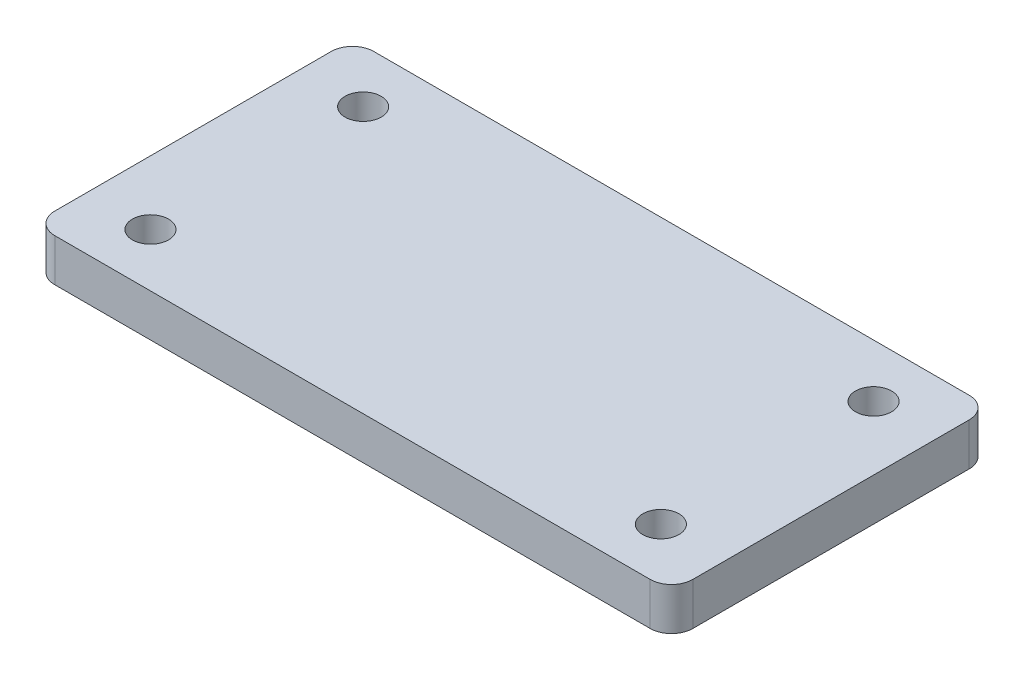
ISO-10303-21;
HEADER;
FILE_DESCRIPTION(('STEP AP214'),'2;1');
FILE_NAME('part.step','',(''),(''),'','','');
FILE_SCHEMA(('AUTOMOTIVE_DESIGN { 1 0 10303 214 1 1 1 1 }'));
ENDSEC;
DATA;
#1=APPLICATION_CONTEXT('core data for automotive mechanical design processes');
#2=APPLICATION_PROTOCOL_DEFINITION('international standard','automotive_design',2000,#1);
#3=PRODUCT_CONTEXT('',#1,'mechanical');
#4=PRODUCT('Part','Part','',(#3));
#5=PRODUCT_RELATED_PRODUCT_CATEGORY('part','',(#4));
#6=PRODUCT_DEFINITION_FORMATION('','',#4);
#7=PRODUCT_DEFINITION_CONTEXT('part definition',#1,'design');
#8=PRODUCT_DEFINITION('design','',#6,#7);
#9=PRODUCT_DEFINITION_SHAPE('','',#8);
#10=(LENGTH_UNIT() NAMED_UNIT(*) SI_UNIT(.MILLI.,.METRE.));
#11=(NAMED_UNIT(*) PLANE_ANGLE_UNIT() SI_UNIT($,.RADIAN.));
#12=(NAMED_UNIT(*) SI_UNIT($,.STERADIAN.) SOLID_ANGLE_UNIT());
#13=UNCERTAINTY_MEASURE_WITH_UNIT(LENGTH_MEASURE(1.E-05),#10,'distance_accuracy_value','');
#14=(GEOMETRIC_REPRESENTATION_CONTEXT(3) GLOBAL_UNCERTAINTY_ASSIGNED_CONTEXT((#13)) GLOBAL_UNIT_ASSIGNED_CONTEXT((#10,
#11,#12)) REPRESENTATION_CONTEXT('',''));
#15=CARTESIAN_POINT('',(0.,0.,0.));
#16=DIRECTION('',(0.,0.,1.));
#17=DIRECTION('',(1.,0.,0.));
#18=AXIS2_PLACEMENT_3D('',#15,#16,#17);
#19=CARTESIAN_POINT('',(-140.,20.,65.));
#20=DIRECTION('',(0.,-1.,0.));
#21=DIRECTION('',(0.,0.,-1.));
#22=AXIS2_PLACEMENT_3D('',#19,#20,#21);
#23=PLANE('',#22);
#24=CARTESIAN_POINT('',(-120.,20.,-50.));
#25=DIRECTION('',(0.,1.,0.));
#26=DIRECTION('',(0.,0.,1.));
#27=AXIS2_PLACEMENT_3D('',#24,#25,#26);
#28=CIRCLE('',#27,8.49999999999999);
#29=CARTESIAN_POINT('',(-120.,20.,-41.5));
#30=VERTEX_POINT('',#29);
#31=EDGE_CURVE('E198',#30,#30,#28,.T.);
#32=ORIENTED_EDGE('',*,*,#31,.F.);
#33=EDGE_LOOP('',(#32));
#34=FACE_BOUND('',#33,.T.);
#35=CARTESIAN_POINT('',(-120.,20.,50.));
#36=DIRECTION('',(0.,1.,0.));
#37=DIRECTION('',(0.,0.,1.));
#38=AXIS2_PLACEMENT_3D('',#35,#36,#37);
#39=CIRCLE('',#38,8.49999999999999);
#40=CARTESIAN_POINT('',(-120.,20.,58.5));
#41=VERTEX_POINT('',#40);
#42=EDGE_CURVE('E192',#41,#41,#39,.T.);
#43=ORIENTED_EDGE('',*,*,#42,.F.);
#44=EDGE_LOOP('',(#43));
#45=FACE_BOUND('',#44,.T.);
#46=CARTESIAN_POINT('',(120.,20.,50.));
#47=DIRECTION('',(0.,1.,0.));
#48=DIRECTION('',(0.,0.,1.));
#49=AXIS2_PLACEMENT_3D('',#46,#47,#48);
#50=CIRCLE('',#49,8.49999999999999);
#51=CARTESIAN_POINT('',(120.,20.,58.5));
#52=VERTEX_POINT('',#51);
#53=EDGE_CURVE('E186',#52,#52,#50,.T.);
#54=ORIENTED_EDGE('',*,*,#53,.F.);
#55=EDGE_LOOP('',(#54));
#56=FACE_BOUND('',#55,.T.);
#57=CARTESIAN_POINT('',(-140.,20.,65.));
#58=DIRECTION('',(0.,1.,0.));
#59=DIRECTION('',(0.,0.,-1.));
#60=AXIS2_PLACEMENT_3D('',#57,#58,#59);
#61=CIRCLE('',#60,10.);
#62=CARTESIAN_POINT('',(-150.,20.,64.9999999999999));
#63=VERTEX_POINT('',#62);
#64=CARTESIAN_POINT('',(-140.,20.,75.));
#65=VERTEX_POINT('',#64);
#66=EDGE_CURVE('E145',#63,#65,#61,.T.);
#67=ORIENTED_EDGE('',*,*,#66,.T.);
#68=DIRECTION('',(1.,0.,0.));
#69=VECTOR('',#68,1.);
#70=CARTESIAN_POINT('',(140.,20.,75.));
#71=LINE('',#70,#69);
#72=CARTESIAN_POINT('',(140.,20.,75.));
#73=VERTEX_POINT('',#72);
#74=EDGE_CURVE('E93',#65,#73,#71,.T.);
#75=ORIENTED_EDGE('',*,*,#74,.T.);
#76=CARTESIAN_POINT('',(140.,20.,65.));
#77=DIRECTION('',(0.,1.,0.));
#78=DIRECTION('',(0.,0.,-1.));
#79=AXIS2_PLACEMENT_3D('',#76,#77,#78);
#80=CIRCLE('',#79,10.);
#81=CARTESIAN_POINT('',(150.,20.,64.9999999999999));
#82=VERTEX_POINT('',#81);
#83=EDGE_CURVE('E160',#73,#82,#80,.T.);
#84=ORIENTED_EDGE('',*,*,#83,.T.);
#85=DIRECTION('',(0.,0.,-1.));
#86=VECTOR('',#85,1.);
#87=CARTESIAN_POINT('',(150.,20.,-64.9999999999999));
#88=LINE('',#87,#86);
#89=CARTESIAN_POINT('',(150.,20.,-64.9999999999999));
#90=VERTEX_POINT('',#89);
#91=EDGE_CURVE('E172',#82,#90,#88,.T.);
#92=ORIENTED_EDGE('',*,*,#91,.T.);
#93=CARTESIAN_POINT('',(140.,20.,-65.));
#94=DIRECTION('',(0.,1.,0.));
#95=DIRECTION('',(0.,0.,-1.));
#96=AXIS2_PLACEMENT_3D('',#93,#94,#95);
#97=CIRCLE('',#96,10.);
#98=CARTESIAN_POINT('',(140.,20.,-75.));
#99=VERTEX_POINT('',#98);
#100=EDGE_CURVE('E112',#90,#99,#97,.T.);
#101=ORIENTED_EDGE('',*,*,#100,.T.);
#102=DIRECTION('',(-1.,0.,0.));
#103=VECTOR('',#102,1.);
#104=CARTESIAN_POINT('',(140.,20.,-75.));
#105=LINE('',#104,#103);
#106=CARTESIAN_POINT('',(-140.,20.,-75.));
#107=VERTEX_POINT('',#106);
#108=EDGE_CURVE('E106',#99,#107,#105,.T.);
#109=ORIENTED_EDGE('',*,*,#108,.T.);
#110=CARTESIAN_POINT('',(-140.,20.,-65.));
#111=DIRECTION('',(0.,1.,0.));
#112=DIRECTION('',(0.,0.,1.));
#113=AXIS2_PLACEMENT_3D('',#110,#111,#112);
#114=CIRCLE('',#113,10.);
#115=CARTESIAN_POINT('',(-150.,20.,-64.9999999999999));
#116=VERTEX_POINT('',#115);
#117=EDGE_CURVE('E110',#107,#116,#114,.T.);
#118=ORIENTED_EDGE('',*,*,#117,.T.);
#119=DIRECTION('',(0.,0.,1.));
#120=VECTOR('',#119,1.);
#121=CARTESIAN_POINT('',(-150.,20.,-64.9999999999999));
#122=LINE('',#121,#120);
#123=EDGE_CURVE('E50',#116,#63,#122,.T.);
#124=ORIENTED_EDGE('',*,*,#123,.T.);
#125=EDGE_LOOP('',(#67,#75,#84,#92,#101,#109,#118,#124));
#126=FACE_BOUND('',#125,.T.);
#127=CARTESIAN_POINT('',(120.,20.,-50.));
#128=DIRECTION('',(0.,1.,0.));
#129=DIRECTION('',(0.,0.,1.));
#130=AXIS2_PLACEMENT_3D('',#127,#128,#129);
#131=CIRCLE('',#130,8.49999999999998);
#132=CARTESIAN_POINT('',(120.,20.,-41.5));
#133=VERTEX_POINT('',#132);
#134=EDGE_CURVE('E180',#133,#133,#131,.T.);
#135=ORIENTED_EDGE('',*,*,#134,.F.);
#136=EDGE_LOOP('',(#135));
#137=FACE_BOUND('',#136,.T.);
#138=ADVANCED_FACE('F33',(#34,#45,#56,#126,#137),#23,.F.);
#139=CARTESIAN_POINT('',(-140.,20.,65.));
#140=DIRECTION('',(0.,-1.,0.));
#141=DIRECTION('',(0.,0.,-1.));
#142=AXIS2_PLACEMENT_3D('',#139,#140,#141);
#143=CYLINDRICAL_SURFACE('',#142,10.);
#144=CARTESIAN_POINT('',(-140.,0.,65.));
#145=DIRECTION('',(0.,1.,0.));
#146=DIRECTION('',(0.,0.,-1.));
#147=AXIS2_PLACEMENT_3D('',#144,#145,#146);
#148=CIRCLE('',#147,10.);
#149=CARTESIAN_POINT('',(-150.,0.,64.9999999999999));
#150=VERTEX_POINT('',#149);
#151=CARTESIAN_POINT('',(-140.,0.,75.));
#152=VERTEX_POINT('',#151);
#153=EDGE_CURVE('E130',#150,#152,#148,.T.);
#154=ORIENTED_EDGE('',*,*,#153,.T.);
#155=DIRECTION('',(0.,-1.,0.));
#156=VECTOR('',#155,1.);
#157=CARTESIAN_POINT('',(-140.,20.,75.));
#158=LINE('',#157,#156);
#159=EDGE_CURVE('E11',#65,#152,#158,.T.);
#160=ORIENTED_EDGE('',*,*,#159,.F.);
#161=ORIENTED_EDGE('',*,*,#66,.F.);
#162=DIRECTION('',(0.,-1.,0.));
#163=VECTOR('',#162,1.);
#164=CARTESIAN_POINT('',(-150.,20.,64.9999999999999));
#165=LINE('',#164,#163);
#166=EDGE_CURVE('E126',#63,#150,#165,.T.);
#167=ORIENTED_EDGE('',*,*,#166,.T.);
#168=EDGE_LOOP('',(#154,#160,#161,#167));
#169=FACE_BOUND('',#168,.T.);
#170=ADVANCED_FACE('F35',(#169),#143,.T.);
#171=CARTESIAN_POINT('',(140.,20.,75.));
#172=DIRECTION('',(0.,0.,-1.));
#173=DIRECTION('',(-1.,0.,0.));
#174=AXIS2_PLACEMENT_3D('',#171,#172,#173);
#175=PLANE('',#174);
#176=DIRECTION('',(1.,0.,0.));
#177=VECTOR('',#176,1.);
#178=CARTESIAN_POINT('',(140.,0.,75.));
#179=LINE('',#178,#177);
#180=CARTESIAN_POINT('',(140.,0.,75.));
#181=VERTEX_POINT('',#180);
#182=EDGE_CURVE('E133',#152,#181,#179,.T.);
#183=ORIENTED_EDGE('',*,*,#182,.T.);
#184=DIRECTION('',(0.,-1.,0.));
#185=VECTOR('',#184,1.);
#186=CARTESIAN_POINT('',(140.,20.,75.));
#187=LINE('',#186,#185);
#188=EDGE_CURVE('E42',#73,#181,#187,.T.);
#189=ORIENTED_EDGE('',*,*,#188,.F.);
#190=ORIENTED_EDGE('',*,*,#74,.F.);
#191=ORIENTED_EDGE('',*,*,#159,.T.);
#192=EDGE_LOOP('',(#183,#189,#190,#191));
#193=FACE_BOUND('',#192,.T.);
#194=ADVANCED_FACE('F245',(#193),#175,.F.);
#195=CARTESIAN_POINT('',(140.,20.,65.));
#196=DIRECTION('',(0.,-1.,0.));
#197=DIRECTION('',(0.,0.,-1.));
#198=AXIS2_PLACEMENT_3D('',#195,#196,#197);
#199=CYLINDRICAL_SURFACE('',#198,10.);
#200=CARTESIAN_POINT('',(140.,0.,65.));
#201=DIRECTION('',(0.,1.,0.));
#202=DIRECTION('',(0.,0.,-1.));
#203=AXIS2_PLACEMENT_3D('',#200,#201,#202);
#204=CIRCLE('',#203,10.);
#205=CARTESIAN_POINT('',(150.,0.,64.9999999999999));
#206=VERTEX_POINT('',#205);
#207=EDGE_CURVE('E136',#181,#206,#204,.T.);
#208=ORIENTED_EDGE('',*,*,#207,.T.);
#209=DIRECTION('',(0.,-1.,0.));
#210=VECTOR('',#209,1.);
#211=CARTESIAN_POINT('',(150.,20.,64.9999999999999));
#212=LINE('',#211,#210);
#213=EDGE_CURVE('E152',#82,#206,#212,.T.);
#214=ORIENTED_EDGE('',*,*,#213,.F.);
#215=ORIENTED_EDGE('',*,*,#83,.F.);
#216=ORIENTED_EDGE('',*,*,#188,.T.);
#217=EDGE_LOOP('',(#208,#214,#215,#216));
#218=FACE_BOUND('',#217,.T.);
#219=ADVANCED_FACE('F158',(#218),#199,.T.);
#220=CARTESIAN_POINT('',(150.,20.,-64.9999999999999));
#221=DIRECTION('',(-1.,0.,0.));
#222=DIRECTION('',(0.,0.,1.));
#223=AXIS2_PLACEMENT_3D('',#220,#221,#222);
#224=PLANE('',#223);
#225=DIRECTION('',(0.,0.,-1.));
#226=VECTOR('',#225,1.);
#227=CARTESIAN_POINT('',(150.,0.,-64.9999999999999));
#228=LINE('',#227,#226);
#229=CARTESIAN_POINT('',(150.,0.,-64.9999999999999));
#230=VERTEX_POINT('',#229);
#231=EDGE_CURVE('E138',#206,#230,#228,.T.);
#232=ORIENTED_EDGE('',*,*,#231,.T.);
#233=DIRECTION('',(0.,-1.,0.));
#234=VECTOR('',#233,1.);
#235=CARTESIAN_POINT('',(150.,20.,-64.9999999999999));
#236=LINE('',#235,#234);
#237=EDGE_CURVE('E149',#90,#230,#236,.T.);
#238=ORIENTED_EDGE('',*,*,#237,.F.);
#239=ORIENTED_EDGE('',*,*,#91,.F.);
#240=ORIENTED_EDGE('',*,*,#213,.T.);
#241=EDGE_LOOP('',(#232,#238,#239,#240));
#242=FACE_BOUND('',#241,.T.);
#243=ADVANCED_FACE('F168',(#242),#224,.F.);
#244=CARTESIAN_POINT('',(140.,20.,-65.));
#245=DIRECTION('',(0.,-1.,0.));
#246=DIRECTION('',(0.,0.,-1.));
#247=AXIS2_PLACEMENT_3D('',#244,#245,#246);
#248=CYLINDRICAL_SURFACE('',#247,10.);
#249=CARTESIAN_POINT('',(140.,0.,-65.));
#250=DIRECTION('',(0.,1.,0.));
#251=DIRECTION('',(0.,0.,-1.));
#252=AXIS2_PLACEMENT_3D('',#249,#250,#251);
#253=CIRCLE('',#252,10.);
#254=CARTESIAN_POINT('',(140.,0.,-75.));
#255=VERTEX_POINT('',#254);
#256=EDGE_CURVE('E140',#230,#255,#253,.T.);
#257=ORIENTED_EDGE('',*,*,#256,.T.);
#258=DIRECTION('',(0.,-1.,0.));
#259=VECTOR('',#258,1.);
#260=CARTESIAN_POINT('',(140.,20.,-75.));
#261=LINE('',#260,#259);
#262=EDGE_CURVE('E121',#99,#255,#261,.T.);
#263=ORIENTED_EDGE('',*,*,#262,.F.);
#264=ORIENTED_EDGE('',*,*,#100,.F.);
#265=ORIENTED_EDGE('',*,*,#237,.T.);
#266=EDGE_LOOP('',(#257,#263,#264,#265));
#267=FACE_BOUND('',#266,.T.);
#268=ADVANCED_FACE('F171',(#267),#248,.T.);
#269=CARTESIAN_POINT('',(140.,20.,-75.));
#270=DIRECTION('',(0.,0.,1.));
#271=DIRECTION('',(1.,0.,0.));
#272=AXIS2_PLACEMENT_3D('',#269,#270,#271);
#273=PLANE('',#272);
#274=DIRECTION('',(-1.,0.,0.));
#275=VECTOR('',#274,1.);
#276=CARTESIAN_POINT('',(140.,0.,-75.));
#277=LINE('',#276,#275);
#278=CARTESIAN_POINT('',(-140.,0.,-75.));
#279=VERTEX_POINT('',#278);
#280=EDGE_CURVE('E120',#255,#279,#277,.T.);
#281=ORIENTED_EDGE('',*,*,#280,.T.);
#282=DIRECTION('',(0.,-1.,0.));
#283=VECTOR('',#282,1.);
#284=CARTESIAN_POINT('',(-140.,20.,-75.));
#285=LINE('',#284,#283);
#286=EDGE_CURVE('E117',#107,#279,#285,.T.);
#287=ORIENTED_EDGE('',*,*,#286,.F.);
#288=ORIENTED_EDGE('',*,*,#108,.F.);
#289=ORIENTED_EDGE('',*,*,#262,.T.);
#290=EDGE_LOOP('',(#281,#287,#288,#289));
#291=FACE_BOUND('',#290,.T.);
#292=ADVANCED_FACE('F118',(#291),#273,.F.);
#293=CARTESIAN_POINT('',(-140.,20.,-65.));
#294=DIRECTION('',(0.,-1.,0.));
#295=DIRECTION('',(0.,0.,-1.));
#296=AXIS2_PLACEMENT_3D('',#293,#294,#295);
#297=CYLINDRICAL_SURFACE('',#296,10.);
#298=CARTESIAN_POINT('',(-140.,0.,-65.));
#299=DIRECTION('',(0.,1.,0.));
#300=DIRECTION('',(0.,0.,1.));
#301=AXIS2_PLACEMENT_3D('',#298,#299,#300);
#302=CIRCLE('',#301,10.);
#303=CARTESIAN_POINT('',(-150.,0.,-64.9999999999999));
#304=VERTEX_POINT('',#303);
#305=EDGE_CURVE('E79',#279,#304,#302,.T.);
#306=ORIENTED_EDGE('',*,*,#305,.T.);
#307=DIRECTION('',(0.,-1.,0.));
#308=VECTOR('',#307,1.);
#309=CARTESIAN_POINT('',(-150.,20.,-64.9999999999999));
#310=LINE('',#309,#308);
#311=EDGE_CURVE('E122',#116,#304,#310,.T.);
#312=ORIENTED_EDGE('',*,*,#311,.F.);
#313=ORIENTED_EDGE('',*,*,#117,.F.);
#314=ORIENTED_EDGE('',*,*,#286,.T.);
#315=EDGE_LOOP('',(#306,#312,#313,#314));
#316=FACE_BOUND('',#315,.T.);
#317=ADVANCED_FACE('F124',(#316),#297,.T.);
#318=CARTESIAN_POINT('',(-150.,20.,-64.9999999999999));
#319=DIRECTION('',(1.,0.,0.));
#320=DIRECTION('',(0.,0.,-1.));
#321=AXIS2_PLACEMENT_3D('',#318,#319,#320);
#322=PLANE('',#321);
#323=DIRECTION('',(0.,0.,1.));
#324=VECTOR('',#323,1.);
#325=CARTESIAN_POINT('',(-150.,0.,-64.9999999999999));
#326=LINE('',#325,#324);
#327=EDGE_CURVE('E85',#304,#150,#326,.T.);
#328=ORIENTED_EDGE('',*,*,#327,.T.);
#329=ORIENTED_EDGE('',*,*,#166,.F.);
#330=ORIENTED_EDGE('',*,*,#123,.F.);
#331=ORIENTED_EDGE('',*,*,#311,.T.);
#332=EDGE_LOOP('',(#328,#329,#330,#331));
#333=FACE_BOUND('',#332,.T.);
#334=ADVANCED_FACE('F222',(#333),#322,.F.);
#335=CARTESIAN_POINT('',(-140.,0.,65.));
#336=DIRECTION('',(0.,-1.,0.));
#337=DIRECTION('',(0.,0.,-1.));
#338=AXIS2_PLACEMENT_3D('',#335,#336,#337);
#339=PLANE('',#338);
#340=CARTESIAN_POINT('',(-120.,0.,-50.));
#341=DIRECTION('',(0.,-1.,0.));
#342=DIRECTION('',(0.,0.,-1.));
#343=AXIS2_PLACEMENT_3D('',#340,#341,#342);
#344=CIRCLE('',#343,8.49999999999999);
#345=CARTESIAN_POINT('',(-120.,0.,-58.5));
#346=VERTEX_POINT('',#345);
#347=EDGE_CURVE('E195',#346,#346,#344,.T.);
#348=ORIENTED_EDGE('',*,*,#347,.F.);
#349=EDGE_LOOP('',(#348));
#350=FACE_BOUND('',#349,.T.);
#351=CARTESIAN_POINT('',(-120.,0.,50.));
#352=DIRECTION('',(0.,-1.,0.));
#353=DIRECTION('',(0.,0.,-1.));
#354=AXIS2_PLACEMENT_3D('',#351,#352,#353);
#355=CIRCLE('',#354,8.49999999999999);
#356=CARTESIAN_POINT('',(-120.,0.,41.5));
#357=VERTEX_POINT('',#356);
#358=EDGE_CURVE('E189',#357,#357,#355,.T.);
#359=ORIENTED_EDGE('',*,*,#358,.F.);
#360=EDGE_LOOP('',(#359));
#361=FACE_BOUND('',#360,.T.);
#362=CARTESIAN_POINT('',(120.,0.,50.));
#363=DIRECTION('',(0.,-1.,0.));
#364=DIRECTION('',(0.,0.,-1.));
#365=AXIS2_PLACEMENT_3D('',#362,#363,#364);
#366=CIRCLE('',#365,8.49999999999999);
#367=CARTESIAN_POINT('',(120.,0.,41.5));
#368=VERTEX_POINT('',#367);
#369=EDGE_CURVE('E183',#368,#368,#366,.T.);
#370=ORIENTED_EDGE('',*,*,#369,.F.);
#371=EDGE_LOOP('',(#370));
#372=FACE_BOUND('',#371,.T.);
#373=CARTESIAN_POINT('',(120.,0.,-50.));
#374=DIRECTION('',(0.,-1.,0.));
#375=DIRECTION('',(0.,0.,-1.));
#376=AXIS2_PLACEMENT_3D('',#373,#374,#375);
#377=CIRCLE('',#376,8.49999999999999);
#378=CARTESIAN_POINT('',(120.,0.,-58.5));
#379=VERTEX_POINT('',#378);
#380=EDGE_CURVE('E134',#379,#379,#377,.T.);
#381=ORIENTED_EDGE('',*,*,#380,.F.);
#382=EDGE_LOOP('',(#381));
#383=FACE_BOUND('',#382,.T.);
#384=ORIENTED_EDGE('',*,*,#153,.F.);
#385=ORIENTED_EDGE('',*,*,#327,.F.);
#386=ORIENTED_EDGE('',*,*,#305,.F.);
#387=ORIENTED_EDGE('',*,*,#280,.F.);
#388=ORIENTED_EDGE('',*,*,#256,.F.);
#389=ORIENTED_EDGE('',*,*,#231,.F.);
#390=ORIENTED_EDGE('',*,*,#207,.F.);
#391=ORIENTED_EDGE('',*,*,#182,.F.);
#392=EDGE_LOOP('',(#384,#385,#386,#387,#388,#389,#390,#391));
#393=FACE_BOUND('',#392,.T.);
#394=ADVANCED_FACE('F164',(#350,#361,#372,#383,#393),#339,.T.);
#395=CARTESIAN_POINT('',(120.,20.,-50.));
#396=DIRECTION('',(0.,1.,0.));
#397=DIRECTION('',(0.,0.,1.));
#398=AXIS2_PLACEMENT_3D('',#395,#396,#397);
#399=CYLINDRICAL_SURFACE('',#398,8.49999999999999);
#400=ORIENTED_EDGE('',*,*,#134,.T.);
#401=EDGE_LOOP('',(#400));
#402=FACE_BOUND('',#401,.T.);
#403=ORIENTED_EDGE('',*,*,#380,.T.);
#404=EDGE_LOOP('',(#403));
#405=FACE_BOUND('',#404,.T.);
#406=ADVANCED_FACE('F216',(#402,#405),#399,.F.);
#407=CARTESIAN_POINT('',(120.,20.,50.));
#408=DIRECTION('',(0.,1.,0.));
#409=DIRECTION('',(0.,0.,1.));
#410=AXIS2_PLACEMENT_3D('',#407,#408,#409);
#411=CYLINDRICAL_SURFACE('',#410,8.49999999999999);
#412=ORIENTED_EDGE('',*,*,#53,.T.);
#413=EDGE_LOOP('',(#412));
#414=FACE_BOUND('',#413,.T.);
#415=ORIENTED_EDGE('',*,*,#369,.T.);
#416=EDGE_LOOP('',(#415));
#417=FACE_BOUND('',#416,.T.);
#418=ADVANCED_FACE('F212',(#414,#417),#411,.F.);
#419=CARTESIAN_POINT('',(-120.,20.,50.));
#420=DIRECTION('',(0.,1.,0.));
#421=DIRECTION('',(0.,0.,1.));
#422=AXIS2_PLACEMENT_3D('',#419,#420,#421);
#423=CYLINDRICAL_SURFACE('',#422,8.49999999999999);
#424=ORIENTED_EDGE('',*,*,#42,.T.);
#425=EDGE_LOOP('',(#424));
#426=FACE_BOUND('',#425,.T.);
#427=ORIENTED_EDGE('',*,*,#358,.T.);
#428=EDGE_LOOP('',(#427));
#429=FACE_BOUND('',#428,.T.);
#430=ADVANCED_FACE('F215',(#426,#429),#423,.F.);
#431=CARTESIAN_POINT('',(-120.,20.,-50.));
#432=DIRECTION('',(0.,1.,0.));
#433=DIRECTION('',(0.,0.,1.));
#434=AXIS2_PLACEMENT_3D('',#431,#432,#433);
#435=CYLINDRICAL_SURFACE('',#434,8.49999999999999);
#436=ORIENTED_EDGE('',*,*,#31,.T.);
#437=EDGE_LOOP('',(#436));
#438=FACE_BOUND('',#437,.T.);
#439=ORIENTED_EDGE('',*,*,#347,.T.);
#440=EDGE_LOOP('',(#439));
#441=FACE_BOUND('',#440,.T.);
#442=ADVANCED_FACE('F202',(#438,#441),#435,.F.);
#443=CLOSED_SHELL('',(#138,#170,#194,#219,#243,#268,#292,#317,#334,#394,#406,#418,#430,#442));
#444=MANIFOLD_SOLID_BREP('B2',#443);
#445=ADVANCED_BREP_SHAPE_REPRESENTATION('',(#18,#444),#14);
#446=SHAPE_DEFINITION_REPRESENTATION(#9,#445);
ENDSEC;
END-ISO-10303-21;
